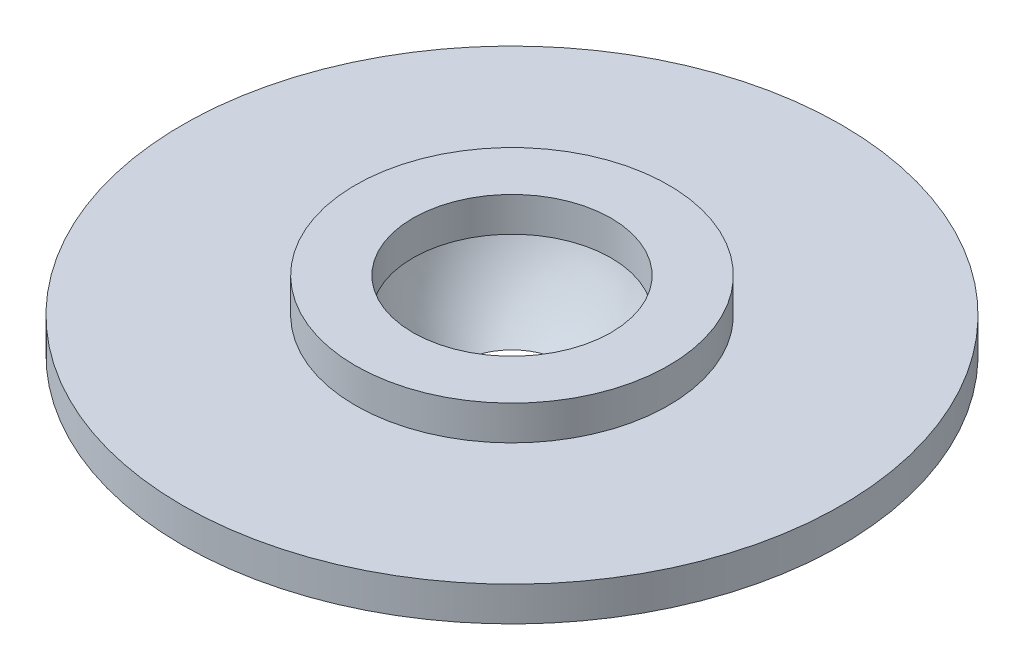
ISO-10303-21;
HEADER;
FILE_DESCRIPTION(('STEP AP214'),'2;1');
FILE_NAME('part.step','',(''),(''),'','','');
FILE_SCHEMA(('AUTOMOTIVE_DESIGN { 1 0 10303 214 1 1 1 1 }'));
ENDSEC;
DATA;
#1=APPLICATION_CONTEXT('core data for automotive mechanical design processes');
#2=APPLICATION_PROTOCOL_DEFINITION('international standard','automotive_design',2000,#1);
#3=PRODUCT_CONTEXT('',#1,'mechanical');
#4=PRODUCT('Part','Part','',(#3));
#5=PRODUCT_RELATED_PRODUCT_CATEGORY('part','',(#4));
#6=PRODUCT_DEFINITION_FORMATION('','',#4);
#7=PRODUCT_DEFINITION_CONTEXT('part definition',#1,'design');
#8=PRODUCT_DEFINITION('design','',#6,#7);
#9=PRODUCT_DEFINITION_SHAPE('','',#8);
#10=(LENGTH_UNIT() NAMED_UNIT(*) SI_UNIT(.MILLI.,.METRE.));
#11=(NAMED_UNIT(*) PLANE_ANGLE_UNIT() SI_UNIT($,.RADIAN.));
#12=(NAMED_UNIT(*) SI_UNIT($,.STERADIAN.) SOLID_ANGLE_UNIT());
#13=UNCERTAINTY_MEASURE_WITH_UNIT(LENGTH_MEASURE(1.E-05),#10,'distance_accuracy_value','');
#14=(GEOMETRIC_REPRESENTATION_CONTEXT(3) GLOBAL_UNCERTAINTY_ASSIGNED_CONTEXT((#13)) GLOBAL_UNIT_ASSIGNED_CONTEXT((#10,
#11,#12)) REPRESENTATION_CONTEXT('',''));
#15=CARTESIAN_POINT('',(0.,0.,0.));
#16=DIRECTION('',(0.,0.,1.));
#17=DIRECTION('',(1.,0.,0.));
#18=AXIS2_PLACEMENT_3D('',#15,#16,#17);
#19=CARTESIAN_POINT('',(0.,35.1513734228963,0.));
#20=DIRECTION('',(0.,1.,0.));
#21=DIRECTION('',(0.,0.,1.));
#22=AXIS2_PLACEMENT_3D('',#19,#20,#21);
#23=CYLINDRICAL_SURFACE('',#22,19.);
#24=CARTESIAN_POINT('',(0.,0.,0.));
#25=DIRECTION('',(0.,1.,0.));
#26=DIRECTION('',(0.,0.,1.));
#27=AXIS2_PLACEMENT_3D('',#24,#25,#26);
#28=CIRCLE('',#27,19.);
#29=CARTESIAN_POINT('',(0.,0.,19.));
#30=VERTEX_POINT('',#29);
#31=EDGE_CURVE('E80',#30,#30,#28,.T.);
#32=ORIENTED_EDGE('',*,*,#31,.F.);
#33=EDGE_LOOP('',(#32));
#34=FACE_BOUND('',#33,.T.);
#35=CARTESIAN_POINT('',(0.,-4.,0.));
#36=DIRECTION('',(0.,1.,0.));
#37=DIRECTION('',(0.,0.,1.));
#38=AXIS2_PLACEMENT_3D('',#35,#36,#37);
#39=CIRCLE('',#38,19.);
#40=CARTESIAN_POINT('',(0.,-4.,19.));
#41=VERTEX_POINT('',#40);
#42=EDGE_CURVE('E10',#41,#41,#39,.T.);
#43=ORIENTED_EDGE('',*,*,#42,.T.);
#44=EDGE_LOOP('',(#43));
#45=FACE_BOUND('',#44,.T.);
#46=ADVANCED_FACE('F41',(#34,#45),#23,.T.);
#47=CARTESIAN_POINT('',(19.,-4.,0.));
#48=DIRECTION('',(0.,1.,0.));
#49=DIRECTION('',(0.,0.,1.));
#50=AXIS2_PLACEMENT_3D('',#47,#48,#49);
#51=PLANE('',#50);
#52=ORIENTED_EDGE('',*,*,#42,.F.);
#53=EDGE_LOOP('',(#52));
#54=FACE_BOUND('',#53,.T.);
#55=CARTESIAN_POINT('',(0.,-4.,0.));
#56=DIRECTION('',(0.,1.,0.));
#57=DIRECTION('',(0.,0.,1.));
#58=AXIS2_PLACEMENT_3D('',#55,#56,#57);
#59=CIRCLE('',#58,6.39891506484761);
#60=CARTESIAN_POINT('',(0.,-4.,6.39891506484761));
#61=VERTEX_POINT('',#60);
#62=EDGE_CURVE('E48',#61,#61,#59,.T.);
#63=ORIENTED_EDGE('',*,*,#62,.T.);
#64=EDGE_LOOP('',(#63));
#65=FACE_BOUND('',#64,.T.);
#66=ADVANCED_FACE('F88',(#54,#65),#51,.F.);
#67=CARTESIAN_POINT('',(0.,11.9061273083827,0.));
#68=DIRECTION('',(0.,1.,0.));
#69=DIRECTION('',(0.,0.,1.));
#70=AXIS2_PLACEMENT_3D('',#67,#68,#69);
#71=DEGENERATE_TOROIDAL_SURFACE('',#70,7.95124679522721,21.4226989747049,.F.);
#72=ORIENTED_EDGE('',*,*,#62,.F.);
#73=EDGE_LOOP('',(#72));
#74=FACE_BOUND('',#73,.T.);
#75=CARTESIAN_POINT('',(0.,4.18062450903377,0.));
#76=DIRECTION('',(0.,1.,0.));
#77=DIRECTION('',(0.,0.,1.));
#78=AXIS2_PLACEMENT_3D('',#75,#76,#77);
#79=CIRCLE('',#78,12.0299603219135);
#80=CARTESIAN_POINT('',(0.,4.18062450903377,12.0299603219135));
#81=VERTEX_POINT('',#80);
#82=EDGE_CURVE('E53',#81,#81,#79,.T.);
#83=ORIENTED_EDGE('',*,*,#82,.T.);
#84=EDGE_LOOP('',(#83));
#85=FACE_BOUND('',#84,.T.);
#86=ADVANCED_FACE('F92',(#74,#85),#71,.T.);
#87=CARTESIAN_POINT('',(0.,35.1513734228963,0.));
#88=DIRECTION('',(0.,1.,0.));
#89=DIRECTION('',(0.,0.,1.));
#90=AXIS2_PLACEMENT_3D('',#87,#88,#89);
#91=CYLINDRICAL_SURFACE('',#90,12.0299603219135);
#92=ORIENTED_EDGE('',*,*,#82,.F.);
#93=EDGE_LOOP('',(#92));
#94=FACE_BOUND('',#93,.T.);
#95=CARTESIAN_POINT('',(0.,8.36124901806755,0.));
#96=DIRECTION('',(0.,1.,0.));
#97=DIRECTION('',(0.,0.,1.));
#98=AXIS2_PLACEMENT_3D('',#95,#96,#97);
#99=CIRCLE('',#98,12.0299603219135);
#100=CARTESIAN_POINT('',(0.,8.36124901806755,12.0299603219135));
#101=VERTEX_POINT('',#100);
#102=EDGE_CURVE('E58',#101,#101,#99,.T.);
#103=ORIENTED_EDGE('',*,*,#102,.T.);
#104=EDGE_LOOP('',(#103));
#105=FACE_BOUND('',#104,.T.);
#106=ADVANCED_FACE('F97',(#94,#105),#91,.F.);
#107=CARTESIAN_POINT('',(12.0299603219135,8.36124901806755,0.));
#108=DIRECTION('',(0.,-1.,0.));
#109=DIRECTION('',(0.,0.,-1.));
#110=AXIS2_PLACEMENT_3D('',#107,#108,#109);
#111=PLANE('',#110);
#112=ORIENTED_EDGE('',*,*,#102,.F.);
#113=EDGE_LOOP('',(#112));
#114=FACE_BOUND('',#113,.T.);
#115=CARTESIAN_POINT('',(0.,8.36124901806755,0.));
#116=DIRECTION('',(0.,1.,0.));
#117=DIRECTION('',(0.,0.,1.));
#118=AXIS2_PLACEMENT_3D('',#115,#116,#117);
#119=CIRCLE('',#118,19.);
#120=CARTESIAN_POINT('',(0.,8.36124901806755,19.));
#121=VERTEX_POINT('',#120);
#122=EDGE_CURVE('E64',#121,#121,#119,.T.);
#123=ORIENTED_EDGE('',*,*,#122,.T.);
#124=EDGE_LOOP('',(#123));
#125=FACE_BOUND('',#124,.T.);
#126=ADVANCED_FACE('F103',(#114,#125),#111,.F.);
#127=CARTESIAN_POINT('',(0.,35.1513734228963,0.));
#128=DIRECTION('',(0.,1.,0.));
#129=DIRECTION('',(0.,0.,1.));
#130=AXIS2_PLACEMENT_3D('',#127,#128,#129);
#131=CYLINDRICAL_SURFACE('',#130,19.);
#132=ORIENTED_EDGE('',*,*,#122,.F.);
#133=EDGE_LOOP('',(#132));
#134=FACE_BOUND('',#133,.T.);
#135=CARTESIAN_POINT('',(0.,4.18062450903377,0.));
#136=DIRECTION('',(0.,1.,0.));
#137=DIRECTION('',(0.,0.,1.));
#138=AXIS2_PLACEMENT_3D('',#135,#136,#137);
#139=CIRCLE('',#138,19.);
#140=CARTESIAN_POINT('',(0.,4.18062450903377,19.));
#141=VERTEX_POINT('',#140);
#142=EDGE_CURVE('E68',#141,#141,#139,.T.);
#143=ORIENTED_EDGE('',*,*,#142,.T.);
#144=EDGE_LOOP('',(#143));
#145=FACE_BOUND('',#144,.T.);
#146=ADVANCED_FACE('F107',(#134,#145),#131,.T.);
#147=CARTESIAN_POINT('',(19.,4.18062450903377,0.));
#148=DIRECTION('',(0.,-1.,0.));
#149=DIRECTION('',(0.,0.,-1.));
#150=AXIS2_PLACEMENT_3D('',#147,#148,#149);
#151=PLANE('',#150);
#152=ORIENTED_EDGE('',*,*,#142,.F.);
#153=EDGE_LOOP('',(#152));
#154=FACE_BOUND('',#153,.T.);
#155=CARTESIAN_POINT('',(0.,4.18062450903377,0.));
#156=DIRECTION('',(0.,1.,0.));
#157=DIRECTION('',(0.,0.,1.));
#158=AXIS2_PLACEMENT_3D('',#155,#156,#157);
#159=CIRCLE('',#158,40.);
#160=CARTESIAN_POINT('',(0.,4.18062450903377,40.));
#161=VERTEX_POINT('',#160);
#162=EDGE_CURVE('E72',#161,#161,#159,.T.);
#163=ORIENTED_EDGE('',*,*,#162,.T.);
#164=EDGE_LOOP('',(#163));
#165=FACE_BOUND('',#164,.T.);
#166=ADVANCED_FACE('F111',(#154,#165),#151,.F.);
#167=CARTESIAN_POINT('',(0.,35.1513734228963,0.));
#168=DIRECTION('',(0.,1.,0.));
#169=DIRECTION('',(0.,0.,1.));
#170=AXIS2_PLACEMENT_3D('',#167,#168,#169);
#171=CYLINDRICAL_SURFACE('',#170,40.);
#172=ORIENTED_EDGE('',*,*,#162,.F.);
#173=EDGE_LOOP('',(#172));
#174=FACE_BOUND('',#173,.T.);
#175=CARTESIAN_POINT('',(0.,0.,0.));
#176=DIRECTION('',(0.,1.,0.));
#177=DIRECTION('',(0.,0.,1.));
#178=AXIS2_PLACEMENT_3D('',#175,#176,#177);
#179=CIRCLE('',#178,40.);
#180=CARTESIAN_POINT('',(0.,0.,40.));
#181=VERTEX_POINT('',#180);
#182=EDGE_CURVE('E76',#181,#181,#179,.T.);
#183=ORIENTED_EDGE('',*,*,#182,.T.);
#184=EDGE_LOOP('',(#183));
#185=FACE_BOUND('',#184,.T.);
#186=ADVANCED_FACE('F115',(#174,#185),#171,.T.);
#187=CARTESIAN_POINT('',(40.,0.,0.));
#188=DIRECTION('',(0.,1.,0.));
#189=DIRECTION('',(0.,0.,1.));
#190=AXIS2_PLACEMENT_3D('',#187,#188,#189);
#191=PLANE('',#190);
#192=ORIENTED_EDGE('',*,*,#182,.F.);
#193=EDGE_LOOP('',(#192));
#194=FACE_BOUND('',#193,.T.);
#195=ORIENTED_EDGE('',*,*,#31,.T.);
#196=EDGE_LOOP('',(#195));
#197=FACE_BOUND('',#196,.T.);
#198=ADVANCED_FACE('F85',(#194,#197),#191,.F.);
#199=CLOSED_SHELL('',(#46,#66,#86,#106,#126,#146,#166,#186,#198));
#200=MANIFOLD_SOLID_BREP('B2',#199);
#201=ADVANCED_BREP_SHAPE_REPRESENTATION('',(#18,#200),#14);
#202=SHAPE_DEFINITION_REPRESENTATION(#9,#201);
ENDSEC;
END-ISO-10303-21;
